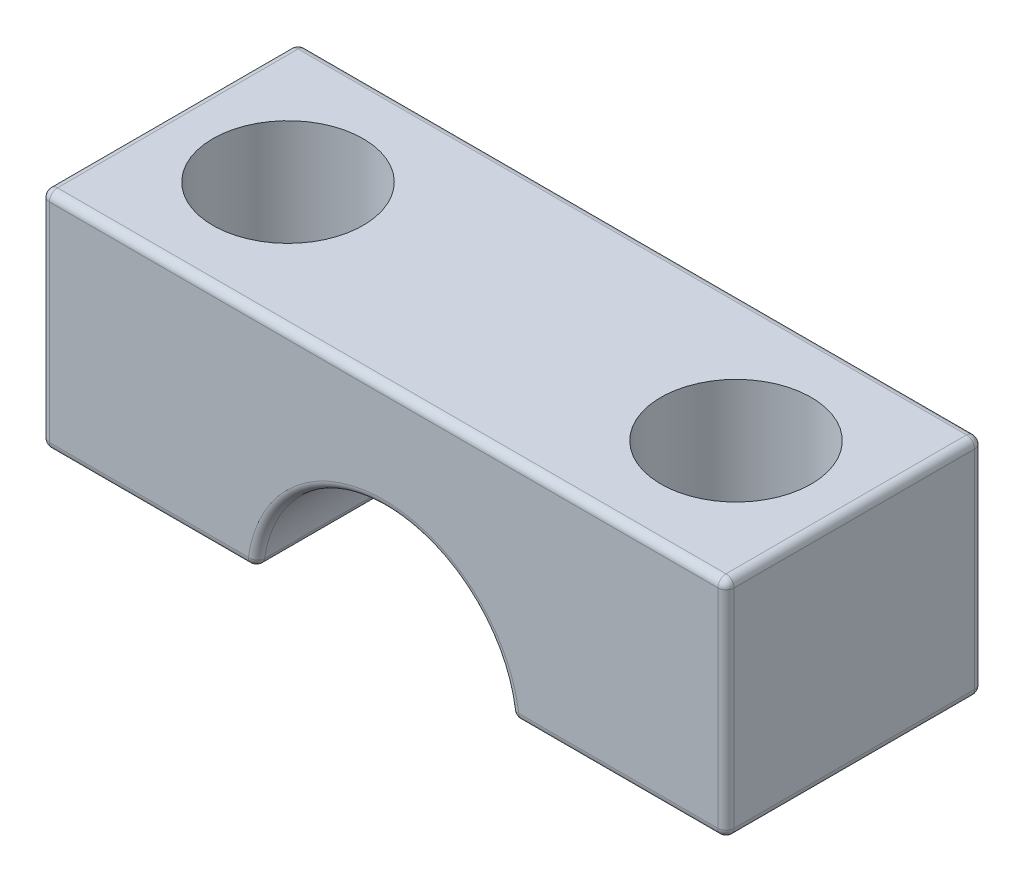
ISO-10303-21;
HEADER;
FILE_DESCRIPTION(('STEP AP214'),'2;1');
FILE_NAME('part.step','',(''),(''),'','','');
FILE_SCHEMA(('AUTOMOTIVE_DESIGN { 1 0 10303 214 1 1 1 1 }'));
ENDSEC;
DATA;
#1=APPLICATION_CONTEXT('core data for automotive mechanical design processes');
#2=APPLICATION_PROTOCOL_DEFINITION('international standard','automotive_design',2000,#1);
#3=PRODUCT_CONTEXT('',#1,'mechanical');
#4=PRODUCT('Part','Part','',(#3));
#5=PRODUCT_RELATED_PRODUCT_CATEGORY('part','',(#4));
#6=PRODUCT_DEFINITION_FORMATION('','',#4);
#7=PRODUCT_DEFINITION_CONTEXT('part definition',#1,'design');
#8=PRODUCT_DEFINITION('design','',#6,#7);
#9=PRODUCT_DEFINITION_SHAPE('','',#8);
#10=(LENGTH_UNIT() NAMED_UNIT(*) SI_UNIT(.MILLI.,.METRE.));
#11=(NAMED_UNIT(*) PLANE_ANGLE_UNIT() SI_UNIT($,.RADIAN.));
#12=(NAMED_UNIT(*) SI_UNIT($,.STERADIAN.) SOLID_ANGLE_UNIT());
#13=UNCERTAINTY_MEASURE_WITH_UNIT(LENGTH_MEASURE(1.E-05),#10,'distance_accuracy_value','');
#14=(GEOMETRIC_REPRESENTATION_CONTEXT(3) GLOBAL_UNCERTAINTY_ASSIGNED_CONTEXT((#13)) GLOBAL_UNIT_ASSIGNED_CONTEXT((#10,
#11,#12)) REPRESENTATION_CONTEXT('',''));
#15=CARTESIAN_POINT('',(0.,0.,0.));
#16=DIRECTION('',(0.,0.,1.));
#17=DIRECTION('',(1.,0.,0.));
#18=AXIS2_PLACEMENT_3D('',#15,#16,#17);
#19=CARTESIAN_POINT('',(-10.468,0.,-6.));
#20=DIRECTION('',(0.,1.,0.));
#21=DIRECTION('',(-1.,0.,0.));
#22=AXIS2_PLACEMENT_3D('',#19,#20,#21);
#23=CYLINDRICAL_SURFACE('',#22,2.254);
#24=CARTESIAN_POINT('',(-10.468,11.968,-6.));
#25=DIRECTION('',(0.,-1.,0.));
#26=DIRECTION('',(1.,0.,0.));
#27=AXIS2_PLACEMENT_3D('',#24,#25,#26);
#28=CIRCLE('',#27,2.254);
#29=CARTESIAN_POINT('',(-8.214,11.968,-6.));
#30=VERTEX_POINT('',#29);
#31=EDGE_CURVE('E380',#30,#30,#28,.T.);
#32=ORIENTED_EDGE('',*,*,#31,.T.);
#33=EDGE_LOOP('',(#32));
#34=FACE_BOUND('',#33,.T.);
#35=CARTESIAN_POINT('',(-10.468,15.445,-6.));
#36=DIRECTION('',(0.,1.,0.));
#37=DIRECTION('',(-1.,0.,0.));
#38=AXIS2_PLACEMENT_3D('',#35,#36,#37);
#39=CIRCLE('',#38,2.254);
#40=CARTESIAN_POINT('',(-12.722,15.445,-6.));
#41=VERTEX_POINT('',#40);
#42=EDGE_CURVE('E370',#41,#41,#39,.F.);
#43=ORIENTED_EDGE('',*,*,#42,.F.);
#44=EDGE_LOOP('',(#43));
#45=FACE_BOUND('',#44,.T.);
#46=ADVANCED_FACE('F39',(#34,#45),#23,.F.);
#47=CARTESIAN_POINT('',(-16.,11.968,-12.));
#48=DIRECTION('',(-1.,0.,0.));
#49=DIRECTION('',(0.,0.,1.));
#50=AXIS2_PLACEMENT_3D('',#47,#48,#49);
#51=PLANE('',#50);
#52=DIRECTION('',(0.,0.,1.));
#53=VECTOR('',#52,1.);
#54=CARTESIAN_POINT('',(-16.,22.079,-12.));
#55=LINE('',#54,#53);
#56=CARTESIAN_POINT('',(-16.,22.079,-0.381));
#57=VERTEX_POINT('',#56);
#58=CARTESIAN_POINT('',(-16.,22.079,-11.619));
#59=VERTEX_POINT('',#58);
#60=EDGE_CURVE('E59',#57,#59,#55,.F.);
#61=ORIENTED_EDGE('',*,*,#60,.T.);
#62=DIRECTION('',(0.,-1.,0.));
#63=VECTOR('',#62,1.);
#64=CARTESIAN_POINT('',(-16.,11.968,-11.619));
#65=LINE('',#64,#63);
#66=CARTESIAN_POINT('',(-16.,12.349,-11.619));
#67=VERTEX_POINT('',#66);
#68=EDGE_CURVE('E11',#59,#67,#65,.T.);
#69=ORIENTED_EDGE('',*,*,#68,.T.);
#70=DIRECTION('',(0.,0.,1.));
#71=VECTOR('',#70,1.);
#72=CARTESIAN_POINT('',(-16.,12.349,-12.));
#73=LINE('',#72,#71);
#74=CARTESIAN_POINT('',(-16.,12.349,-0.381));
#75=VERTEX_POINT('',#74);
#76=EDGE_CURVE('E48',#67,#75,#73,.T.);
#77=ORIENTED_EDGE('',*,*,#76,.T.);
#78=DIRECTION('',(0.,-1.,0.));
#79=VECTOR('',#78,1.);
#80=CARTESIAN_POINT('',(-16.,11.968,-0.380999999999999));
#81=LINE('',#80,#79);
#82=EDGE_CURVE('E263',#75,#57,#81,.F.);
#83=ORIENTED_EDGE('',*,*,#82,.T.);
#84=EDGE_LOOP('',(#61,#69,#77,#83));
#85=FACE_BOUND('',#84,.T.);
#86=ADVANCED_FACE('F444',(#85),#51,.T.);
#87=CARTESIAN_POINT('',(-16.,22.46,-12.));
#88=DIRECTION('',(0.,1.,0.));
#89=DIRECTION('',(-1.,0.,0.));
#90=AXIS2_PLACEMENT_3D('',#87,#88,#89);
#91=PLANE('',#90);
#92=DIRECTION('',(-1.,0.,0.));
#93=VECTOR('',#92,1.);
#94=CARTESIAN_POINT('',(-16.,22.46,-0.380999999999999));
#95=LINE('',#94,#93);
#96=CARTESIAN_POINT('',(-15.619,22.46,-0.381));
#97=VERTEX_POINT('',#96);
#98=CARTESIAN_POINT('',(15.619,22.46,-0.381));
#99=VERTEX_POINT('',#98);
#100=EDGE_CURVE('E199',#97,#99,#95,.F.);
#101=ORIENTED_EDGE('',*,*,#100,.T.);
#102=DIRECTION('',(0.,0.,1.));
#103=VECTOR('',#102,1.);
#104=CARTESIAN_POINT('',(15.619,22.46,-12.));
#105=LINE('',#104,#103);
#106=CARTESIAN_POINT('',(15.619,22.46,-11.619));
#107=VERTEX_POINT('',#106);
#108=EDGE_CURVE('E170',#99,#107,#105,.F.);
#109=ORIENTED_EDGE('',*,*,#108,.T.);
#110=DIRECTION('',(-1.,0.,0.));
#111=VECTOR('',#110,1.);
#112=CARTESIAN_POINT('',(-16.,22.46,-11.619));
#113=LINE('',#112,#111);
#114=CARTESIAN_POINT('',(-15.619,22.46,-11.619));
#115=VERTEX_POINT('',#114);
#116=EDGE_CURVE('E207',#107,#115,#113,.T.);
#117=ORIENTED_EDGE('',*,*,#116,.T.);
#118=DIRECTION('',(0.,0.,1.));
#119=VECTOR('',#118,1.);
#120=CARTESIAN_POINT('',(-15.619,22.46,-12.));
#121=LINE('',#120,#119);
#122=EDGE_CURVE('E201',#115,#97,#121,.T.);
#123=ORIENTED_EDGE('',*,*,#122,.T.);
#124=EDGE_LOOP('',(#101,#109,#117,#123));
#125=FACE_BOUND('',#124,.T.);
#126=CARTESIAN_POINT('',(-10.468,22.46,-6.));
#127=DIRECTION('',(0.,1.,0.));
#128=DIRECTION('',(-1.,0.,0.));
#129=AXIS2_PLACEMENT_3D('',#126,#127,#128);
#130=CIRCLE('',#129,3.5125);
#131=CARTESIAN_POINT('',(-13.9805,22.46,-6.));
#132=VERTEX_POINT('',#131);
#133=EDGE_CURVE('E359',#132,#132,#130,.T.);
#134=ORIENTED_EDGE('',*,*,#133,.F.);
#135=EDGE_LOOP('',(#134));
#136=FACE_BOUND('',#135,.T.);
#137=CARTESIAN_POINT('',(10.468,22.46,-6.));
#138=DIRECTION('',(0.,1.,0.));
#139=DIRECTION('',(1.,0.,0.));
#140=AXIS2_PLACEMENT_3D('',#137,#138,#139);
#141=CIRCLE('',#140,3.5125);
#142=CARTESIAN_POINT('',(13.9805,22.46,-6.));
#143=VERTEX_POINT('',#142);
#144=EDGE_CURVE('E377',#143,#143,#141,.T.);
#145=ORIENTED_EDGE('',*,*,#144,.F.);
#146=EDGE_LOOP('',(#145));
#147=FACE_BOUND('',#146,.T.);
#148=ADVANCED_FACE('F412',(#125,#136,#147),#91,.T.);
#149=CARTESIAN_POINT('',(16.,11.968,-12.));
#150=DIRECTION('',(1.,0.,0.));
#151=DIRECTION('',(0.,0.,-1.));
#152=AXIS2_PLACEMENT_3D('',#149,#150,#151);
#153=PLANE('',#152);
#154=DIRECTION('',(0.,1.,0.));
#155=VECTOR('',#154,1.);
#156=CARTESIAN_POINT('',(16.,22.46,-11.619));
#157=LINE('',#156,#155);
#158=CARTESIAN_POINT('',(16.,12.349,-11.619));
#159=VERTEX_POINT('',#158);
#160=CARTESIAN_POINT('',(16.,22.079,-11.619));
#161=VERTEX_POINT('',#160);
#162=EDGE_CURVE('E197',#159,#161,#157,.T.);
#163=ORIENTED_EDGE('',*,*,#162,.T.);
#164=DIRECTION('',(0.,0.,1.));
#165=VECTOR('',#164,1.);
#166=CARTESIAN_POINT('',(16.,22.079,-12.));
#167=LINE('',#166,#165);
#168=CARTESIAN_POINT('',(16.,22.079,-0.381));
#169=VERTEX_POINT('',#168);
#170=EDGE_CURVE('E168',#161,#169,#167,.T.);
#171=ORIENTED_EDGE('',*,*,#170,.T.);
#172=DIRECTION('',(0.,1.,0.));
#173=VECTOR('',#172,1.);
#174=CARTESIAN_POINT('',(16.,11.968,-0.380999999999999));
#175=LINE('',#174,#173);
#176=CARTESIAN_POINT('',(16.,12.349,-0.381));
#177=VERTEX_POINT('',#176);
#178=EDGE_CURVE('E186',#169,#177,#175,.F.);
#179=ORIENTED_EDGE('',*,*,#178,.T.);
#180=DIRECTION('',(0.,0.,1.));
#181=VECTOR('',#180,1.);
#182=CARTESIAN_POINT('',(16.,12.349,-12.));
#183=LINE('',#182,#181);
#184=EDGE_CURVE('E192',#177,#159,#183,.F.);
#185=ORIENTED_EDGE('',*,*,#184,.T.);
#186=EDGE_LOOP('',(#163,#171,#179,#185));
#187=FACE_BOUND('',#186,.T.);
#188=ADVANCED_FACE('F195',(#187),#153,.T.);
#189=CARTESIAN_POINT('',(5.97845598796211,11.968,-12.));
#190=DIRECTION('',(0.,-1.,0.));
#191=DIRECTION('',(1.,0.,0.));
#192=AXIS2_PLACEMENT_3D('',#189,#190,#191);
#193=PLANE('',#192);
#194=DIRECTION('',(0.,0.,1.));
#195=VECTOR('',#194,1.);
#196=CARTESIAN_POINT('',(6.31876886742979,11.968,-12.));
#197=LINE('',#196,#195);
#198=CARTESIAN_POINT('',(6.31876886742979,11.968,-0.381));
#199=VERTEX_POINT('',#198);
#200=CARTESIAN_POINT('',(6.31876886742979,11.968,-11.619));
#201=VERTEX_POINT('',#200);
#202=EDGE_CURVE('E225',#199,#201,#197,.F.);
#203=ORIENTED_EDGE('',*,*,#202,.T.);
#204=DIRECTION('',(1.,0.,0.));
#205=VECTOR('',#204,1.);
#206=CARTESIAN_POINT('',(16.,11.968,-11.619));
#207=LINE('',#206,#205);
#208=CARTESIAN_POINT('',(15.619,11.968,-11.619));
#209=VERTEX_POINT('',#208);
#210=EDGE_CURVE('E230',#201,#209,#207,.T.);
#211=ORIENTED_EDGE('',*,*,#210,.T.);
#212=DIRECTION('',(0.,0.,1.));
#213=VECTOR('',#212,1.);
#214=CARTESIAN_POINT('',(15.619,11.968,-12.));
#215=LINE('',#214,#213);
#216=CARTESIAN_POINT('',(15.619,11.968,-0.381));
#217=VERTEX_POINT('',#216);
#218=EDGE_CURVE('E227',#209,#217,#215,.T.);
#219=ORIENTED_EDGE('',*,*,#218,.T.);
#220=DIRECTION('',(1.,0.,0.));
#221=VECTOR('',#220,1.);
#222=CARTESIAN_POINT('',(5.97845598796211,11.968,-0.380999999999999));
#223=LINE('',#222,#221);
#224=EDGE_CURVE('E223',#217,#199,#223,.F.);
#225=ORIENTED_EDGE('',*,*,#224,.T.);
#226=EDGE_LOOP('',(#203,#211,#219,#225));
#227=FACE_BOUND('',#226,.T.);
#228=CARTESIAN_POINT('',(10.468,11.968,-6.));
#229=DIRECTION('',(0.,-1.,0.));
#230=DIRECTION('',(1.,0.,0.));
#231=AXIS2_PLACEMENT_3D('',#228,#229,#230);
#232=CIRCLE('',#231,2.254);
#233=CARTESIAN_POINT('',(12.722,11.968,-6.));
#234=VERTEX_POINT('',#233);
#235=EDGE_CURVE('E193',#234,#234,#232,.T.);
#236=ORIENTED_EDGE('',*,*,#235,.F.);
#237=EDGE_LOOP('',(#236));
#238=FACE_BOUND('',#237,.T.);
#239=ADVANCED_FACE('F468',(#227,#238),#193,.T.);
#240=CARTESIAN_POINT('',(0.,11.46,-12.));
#241=DIRECTION('',(0.,0.,1.));
#242=DIRECTION('',(1.,0.,0.));
#243=AXIS2_PLACEMENT_3D('',#240,#241,#242);
#244=CYLINDRICAL_SURFACE('',#243,6.);
#245=DIRECTION('',(0.,0.,1.));
#246=VECTOR('',#245,1.);
#247=CARTESIAN_POINT('',(5.94148459560865,12.2959191349318,-12.));
#248=LINE('',#247,#246);
#249=CARTESIAN_POINT('',(5.94148459560864,12.2959191349318,-11.619));
#250=VERTEX_POINT('',#249);
#251=CARTESIAN_POINT('',(5.94148459560864,12.2959191349318,-0.380999999999999));
#252=VERTEX_POINT('',#251);
#253=EDGE_CURVE('E249',#250,#252,#248,.T.);
#254=ORIENTED_EDGE('',*,*,#253,.T.);
#255=CARTESIAN_POINT('',(0.,11.46,-0.380999999999999));
#256=DIRECTION('',(0.,0.,1.));
#257=DIRECTION('',(1.,0.,0.));
#258=AXIS2_PLACEMENT_3D('',#255,#256,#257);
#259=CIRCLE('',#258,6.);
#260=CARTESIAN_POINT('',(-5.94148459560865,12.2959191349318,-0.380999999999999));
#261=VERTEX_POINT('',#260);
#262=EDGE_CURVE('E252',#252,#261,#259,.T.);
#263=ORIENTED_EDGE('',*,*,#262,.T.);
#264=DIRECTION('',(0.,0.,1.));
#265=VECTOR('',#264,1.);
#266=CARTESIAN_POINT('',(-5.94148459560865,12.2959191349318,-12.));
#267=LINE('',#266,#265);
#268=CARTESIAN_POINT('',(-5.94148459560865,12.2959191349318,-11.619));
#269=VERTEX_POINT('',#268);
#270=EDGE_CURVE('E247',#261,#269,#267,.F.);
#271=ORIENTED_EDGE('',*,*,#270,.T.);
#272=CARTESIAN_POINT('',(0.,11.46,-11.619));
#273=DIRECTION('',(0.,0.,1.));
#274=DIRECTION('',(1.,0.,0.));
#275=AXIS2_PLACEMENT_3D('',#272,#273,#274);
#276=CIRCLE('',#275,6.);
#277=EDGE_CURVE('E245',#269,#250,#276,.F.);
#278=ORIENTED_EDGE('',*,*,#277,.T.);
#279=EDGE_LOOP('',(#254,#263,#271,#278));
#280=FACE_BOUND('',#279,.T.);
#281=ADVANCED_FACE('F471',(#280),#244,.F.);
#282=CARTESIAN_POINT('',(-16.,11.968,-12.));
#283=DIRECTION('',(0.,-1.,0.));
#284=DIRECTION('',(1.,0.,0.));
#285=AXIS2_PLACEMENT_3D('',#282,#283,#284);
#286=PLANE('',#285);
#287=DIRECTION('',(1.,0.,0.));
#288=VECTOR('',#287,1.);
#289=CARTESIAN_POINT('',(-5.97845598796211,11.968,-11.619));
#290=LINE('',#289,#288);
#291=CARTESIAN_POINT('',(-15.619,11.968,-11.619));
#292=VERTEX_POINT('',#291);
#293=CARTESIAN_POINT('',(-6.31876886742979,11.968,-11.619));
#294=VERTEX_POINT('',#293);
#295=EDGE_CURVE('E258',#292,#294,#290,.T.);
#296=ORIENTED_EDGE('',*,*,#295,.T.);
#297=DIRECTION('',(0.,0.,1.));
#298=VECTOR('',#297,1.);
#299=CARTESIAN_POINT('',(-6.31876886742979,11.968,-12.));
#300=LINE('',#299,#298);
#301=CARTESIAN_POINT('',(-6.31876886742979,11.968,-0.381));
#302=VERTEX_POINT('',#301);
#303=EDGE_CURVE('E260',#294,#302,#300,.T.);
#304=ORIENTED_EDGE('',*,*,#303,.T.);
#305=DIRECTION('',(1.,0.,0.));
#306=VECTOR('',#305,1.);
#307=CARTESIAN_POINT('',(-16.,11.968,-0.380999999999999));
#308=LINE('',#307,#306);
#309=CARTESIAN_POINT('',(-15.619,11.968,-0.381));
#310=VERTEX_POINT('',#309);
#311=EDGE_CURVE('E254',#302,#310,#308,.F.);
#312=ORIENTED_EDGE('',*,*,#311,.T.);
#313=DIRECTION('',(0.,0.,1.));
#314=VECTOR('',#313,1.);
#315=CARTESIAN_POINT('',(-15.619,11.968,-12.));
#316=LINE('',#315,#314);
#317=EDGE_CURVE('E256',#310,#292,#316,.F.);
#318=ORIENTED_EDGE('',*,*,#317,.T.);
#319=EDGE_LOOP('',(#296,#304,#312,#318));
#320=FACE_BOUND('',#319,.T.);
#321=ORIENTED_EDGE('',*,*,#31,.F.);
#322=EDGE_LOOP('',(#321));
#323=FACE_BOUND('',#322,.T.);
#324=ADVANCED_FACE('F460',(#320,#323),#286,.T.);
#325=CARTESIAN_POINT('',(0.,11.46,-12.));
#326=DIRECTION('',(0.,0.,1.));
#327=DIRECTION('',(1.,0.,0.));
#328=AXIS2_PLACEMENT_3D('',#325,#326,#327);
#329=PLANE('',#328);
#330=DIRECTION('',(0.,1.,0.));
#331=VECTOR('',#330,1.);
#332=CARTESIAN_POINT('',(15.619,11.968,-12.));
#333=LINE('',#332,#331);
#334=CARTESIAN_POINT('',(15.619,22.079,-12.));
#335=VERTEX_POINT('',#334);
#336=CARTESIAN_POINT('',(15.619,12.349,-12.));
#337=VERTEX_POINT('',#336);
#338=EDGE_CURVE('E218',#335,#337,#333,.F.);
#339=ORIENTED_EDGE('',*,*,#338,.T.);
#340=DIRECTION('',(1.,0.,0.));
#341=VECTOR('',#340,1.);
#342=CARTESIAN_POINT('',(5.97845598796211,12.349,-12.));
#343=LINE('',#342,#341);
#344=CARTESIAN_POINT('',(6.31876886742979,12.349,-12.));
#345=VERTEX_POINT('',#344);
#346=EDGE_CURVE('E221',#337,#345,#343,.F.);
#347=ORIENTED_EDGE('',*,*,#346,.T.);
#348=CARTESIAN_POINT('',(0.,11.46,-12.));
#349=DIRECTION('',(0.,0.,1.));
#350=DIRECTION('',(1.,0.,0.));
#351=AXIS2_PLACEMENT_3D('',#348,#349,#350);
#352=CIRCLE('',#351,6.381);
#353=CARTESIAN_POINT('',(-6.31876886742979,12.349,-12.));
#354=VERTEX_POINT('',#353);
#355=EDGE_CURVE('E216',#345,#354,#352,.T.);
#356=ORIENTED_EDGE('',*,*,#355,.T.);
#357=DIRECTION('',(1.,0.,0.));
#358=VECTOR('',#357,1.);
#359=CARTESIAN_POINT('',(-16.,12.349,-12.));
#360=LINE('',#359,#358);
#361=CARTESIAN_POINT('',(-15.619,12.349,-12.));
#362=VERTEX_POINT('',#361);
#363=EDGE_CURVE('E214',#354,#362,#360,.F.);
#364=ORIENTED_EDGE('',*,*,#363,.T.);
#365=DIRECTION('',(0.,-1.,0.));
#366=VECTOR('',#365,1.);
#367=CARTESIAN_POINT('',(-15.619,22.46,-12.));
#368=LINE('',#367,#366);
#369=CARTESIAN_POINT('',(-15.619,22.079,-12.));
#370=VERTEX_POINT('',#369);
#371=EDGE_CURVE('E210',#362,#370,#368,.F.);
#372=ORIENTED_EDGE('',*,*,#371,.T.);
#373=DIRECTION('',(-1.,0.,0.));
#374=VECTOR('',#373,1.);
#375=CARTESIAN_POINT('',(16.,22.079,-12.));
#376=LINE('',#375,#374);
#377=EDGE_CURVE('E212',#370,#335,#376,.F.);
#378=ORIENTED_EDGE('',*,*,#377,.T.);
#379=EDGE_LOOP('',(#339,#347,#356,#364,#372,#378));
#380=FACE_BOUND('',#379,.T.);
#381=ADVANCED_FACE('F457',(#380),#329,.F.);
#382=CARTESIAN_POINT('',(0.,11.46,0.));
#383=DIRECTION('',(0.,0.,1.));
#384=DIRECTION('',(1.,0.,0.));
#385=AXIS2_PLACEMENT_3D('',#382,#383,#384);
#386=PLANE('',#385);
#387=CARTESIAN_POINT('',(0.,11.46,0.));
#388=DIRECTION('',(0.,0.,1.));
#389=DIRECTION('',(1.,0.,0.));
#390=AXIS2_PLACEMENT_3D('',#387,#388,#389);
#391=CIRCLE('',#390,6.381);
#392=CARTESIAN_POINT('',(-6.31876886742979,12.349,0.));
#393=VERTEX_POINT('',#392);
#394=CARTESIAN_POINT('',(6.31876886742979,12.349,0.));
#395=VERTEX_POINT('',#394);
#396=EDGE_CURVE('E238',#393,#395,#391,.F.);
#397=ORIENTED_EDGE('',*,*,#396,.T.);
#398=DIRECTION('',(1.,0.,0.));
#399=VECTOR('',#398,1.);
#400=CARTESIAN_POINT('',(0.,12.349,0.));
#401=LINE('',#400,#399);
#402=CARTESIAN_POINT('',(15.619,12.349,0.));
#403=VERTEX_POINT('',#402);
#404=EDGE_CURVE('E243',#395,#403,#401,.T.);
#405=ORIENTED_EDGE('',*,*,#404,.T.);
#406=DIRECTION('',(0.,1.,0.));
#407=VECTOR('',#406,1.);
#408=CARTESIAN_POINT('',(15.619,11.46,0.));
#409=LINE('',#408,#407);
#410=CARTESIAN_POINT('',(15.619,22.079,0.));
#411=VERTEX_POINT('',#410);
#412=EDGE_CURVE('E240',#403,#411,#409,.T.);
#413=ORIENTED_EDGE('',*,*,#412,.T.);
#414=DIRECTION('',(-1.,0.,0.));
#415=VECTOR('',#414,1.);
#416=CARTESIAN_POINT('',(0.,22.079,0.));
#417=LINE('',#416,#415);
#418=CARTESIAN_POINT('',(-15.619,22.079,0.));
#419=VERTEX_POINT('',#418);
#420=EDGE_CURVE('E232',#411,#419,#417,.T.);
#421=ORIENTED_EDGE('',*,*,#420,.T.);
#422=DIRECTION('',(0.,-1.,0.));
#423=VECTOR('',#422,1.);
#424=CARTESIAN_POINT('',(-15.619,11.46,0.));
#425=LINE('',#424,#423);
#426=CARTESIAN_POINT('',(-15.619,12.349,0.));
#427=VERTEX_POINT('',#426);
#428=EDGE_CURVE('E234',#419,#427,#425,.T.);
#429=ORIENTED_EDGE('',*,*,#428,.T.);
#430=DIRECTION('',(1.,0.,0.));
#431=VECTOR('',#430,1.);
#432=CARTESIAN_POINT('',(0.,12.349,0.));
#433=LINE('',#432,#431);
#434=EDGE_CURVE('E236',#427,#393,#433,.T.);
#435=ORIENTED_EDGE('',*,*,#434,.T.);
#436=EDGE_LOOP('',(#397,#405,#413,#421,#429,#435));
#437=FACE_BOUND('',#436,.T.);
#438=ADVANCED_FACE('F421',(#437),#386,.T.);
#439=CARTESIAN_POINT('',(10.468,0.,-6.));
#440=DIRECTION('',(0.,1.,0.));
#441=DIRECTION('',(-1.,0.,0.));
#442=AXIS2_PLACEMENT_3D('',#439,#440,#441);
#443=CYLINDRICAL_SURFACE('',#442,2.254);
#444=CARTESIAN_POINT('',(10.468,15.445,-6.));
#445=DIRECTION('',(0.,-1.,0.));
#446=DIRECTION('',(1.,0.,0.));
#447=AXIS2_PLACEMENT_3D('',#444,#445,#446);
#448=CIRCLE('',#447,2.254);
#449=CARTESIAN_POINT('',(12.722,15.445,-6.));
#450=VERTEX_POINT('',#449);
#451=EDGE_CURVE('E376',#450,#450,#448,.F.);
#452=ORIENTED_EDGE('',*,*,#451,.T.);
#453=EDGE_LOOP('',(#452));
#454=FACE_BOUND('',#453,.T.);
#455=ORIENTED_EDGE('',*,*,#235,.T.);
#456=EDGE_LOOP('',(#455));
#457=FACE_BOUND('',#456,.T.);
#458=ADVANCED_FACE('F455',(#454,#457),#443,.F.);
#459=CARTESIAN_POINT('',(10.468,15.445,-6.));
#460=DIRECTION('',(0.,-1.,0.));
#461=DIRECTION('',(1.,0.,0.));
#462=AXIS2_PLACEMENT_3D('',#459,#460,#461);
#463=PLANE('',#462);
#464=CARTESIAN_POINT('',(10.468,15.445,-6.));
#465=DIRECTION('',(0.,1.,0.));
#466=DIRECTION('',(1.,0.,0.));
#467=AXIS2_PLACEMENT_3D('',#464,#465,#466);
#468=CIRCLE('',#467,3.5125);
#469=CARTESIAN_POINT('',(13.9805,15.445,-6.));
#470=VERTEX_POINT('',#469);
#471=EDGE_CURVE('E373',#470,#470,#468,.T.);
#472=ORIENTED_EDGE('',*,*,#471,.T.);
#473=EDGE_LOOP('',(#472));
#474=FACE_BOUND('',#473,.T.);
#475=ORIENTED_EDGE('',*,*,#451,.F.);
#476=EDGE_LOOP('',(#475));
#477=FACE_BOUND('',#476,.T.);
#478=ADVANCED_FACE('F789',(#474,#477),#463,.F.);
#479=CARTESIAN_POINT('',(10.468,15.445,-6.));
#480=DIRECTION('',(0.,1.,0.));
#481=DIRECTION('',(-1.,0.,0.));
#482=AXIS2_PLACEMENT_3D('',#479,#480,#481);
#483=CYLINDRICAL_SURFACE('',#482,3.5125);
#484=ORIENTED_EDGE('',*,*,#471,.F.);
#485=EDGE_LOOP('',(#484));
#486=FACE_BOUND('',#485,.T.);
#487=ORIENTED_EDGE('',*,*,#144,.T.);
#488=EDGE_LOOP('',(#487));
#489=FACE_BOUND('',#488,.T.);
#490=ADVANCED_FACE('F780',(#486,#489),#483,.F.);
#491=CARTESIAN_POINT('',(-10.468,15.445,-6.));
#492=DIRECTION('',(0.,1.,0.));
#493=DIRECTION('',(-1.,0.,0.));
#494=AXIS2_PLACEMENT_3D('',#491,#492,#493);
#495=PLANE('',#494);
#496=CARTESIAN_POINT('',(-10.468,15.445,-6.));
#497=DIRECTION('',(0.,1.,0.));
#498=DIRECTION('',(-1.,0.,0.));
#499=AXIS2_PLACEMENT_3D('',#496,#497,#498);
#500=CIRCLE('',#499,3.5125);
#501=CARTESIAN_POINT('',(-13.9805,15.445,-6.));
#502=VERTEX_POINT('',#501);
#503=EDGE_CURVE('E365',#502,#502,#500,.T.);
#504=ORIENTED_EDGE('',*,*,#503,.T.);
#505=EDGE_LOOP('',(#504));
#506=FACE_BOUND('',#505,.T.);
#507=ORIENTED_EDGE('',*,*,#42,.T.);
#508=EDGE_LOOP('',(#507));
#509=FACE_BOUND('',#508,.T.);
#510=ADVANCED_FACE('F771',(#506,#509),#495,.T.);
#511=CARTESIAN_POINT('',(-10.468,15.445,-6.));
#512=DIRECTION('',(0.,1.,0.));
#513=DIRECTION('',(-1.,0.,0.));
#514=AXIS2_PLACEMENT_3D('',#511,#512,#513);
#515=CYLINDRICAL_SURFACE('',#514,3.5125);
#516=ORIENTED_EDGE('',*,*,#503,.F.);
#517=EDGE_LOOP('',(#516));
#518=FACE_BOUND('',#517,.T.);
#519=ORIENTED_EDGE('',*,*,#133,.T.);
#520=EDGE_LOOP('',(#519));
#521=FACE_BOUND('',#520,.T.);
#522=ADVANCED_FACE('F763',(#518,#521),#515,.F.);
#523=CARTESIAN_POINT('',(-6.31876886742979,12.349,-12.));
#524=DIRECTION('',(0.,0.,1.));
#525=DIRECTION('',(1.,0.,0.));
#526=AXIS2_PLACEMENT_3D('',#523,#524,#525);
#527=CYLINDRICAL_SURFACE('',#526,0.381);
#528=CARTESIAN_POINT('',(-6.31876886742979,12.349,-11.619));
#529=DIRECTION('',(0.,0.,-1.));
#530=DIRECTION('',(-1.,0.,0.));
#531=AXIS2_PLACEMENT_3D('',#528,#529,#530);
#532=CIRCLE('',#531,0.381);
#533=EDGE_CURVE('E43',#269,#294,#532,.T.);
#534=ORIENTED_EDGE('',*,*,#533,.F.);
#535=ORIENTED_EDGE('',*,*,#270,.F.);
#536=CARTESIAN_POINT('',(-6.31876886742979,12.349,-0.381));
#537=DIRECTION('',(0.,0.,1.));
#538=DIRECTION('',(1.,0.,0.));
#539=AXIS2_PLACEMENT_3D('',#536,#537,#538);
#540=CIRCLE('',#539,0.381);
#541=EDGE_CURVE('E352',#302,#261,#540,.T.);
#542=ORIENTED_EDGE('',*,*,#541,.F.);
#543=ORIENTED_EDGE('',*,*,#303,.F.);
#544=EDGE_LOOP('',(#534,#535,#542,#543));
#545=FACE_BOUND('',#544,.T.);
#546=ADVANCED_FACE('F41',(#545),#527,.T.);
#547=CARTESIAN_POINT('',(-6.31876886742979,12.349,-11.619));
#548=DIRECTION('',(0.,0.,1.));
#549=DIRECTION('',(1.,0.,0.));
#550=AXIS2_PLACEMENT_3D('',#547,#548,#549);
#551=SPHERICAL_SURFACE('',#550,0.381);
#552=CARTESIAN_POINT('',(-6.31876886742979,12.349,-11.619));
#553=DIRECTION('',(-0.139319855821969,-0.990247432601441,0.));
#554=DIRECTION('',(0.990247432601441,-0.139319855821969,0.));
#555=AXIS2_PLACEMENT_3D('',#552,#553,#554);
#556=CIRCLE('',#555,0.381);
#557=EDGE_CURVE('E347',#269,#354,#556,.F.);
#558=ORIENTED_EDGE('',*,*,#557,.F.);
#559=ORIENTED_EDGE('',*,*,#533,.T.);
#560=CARTESIAN_POINT('',(-6.31876886742979,12.349,-11.619));
#561=DIRECTION('',(1.,0.,0.));
#562=DIRECTION('',(0.,0.,-1.));
#563=AXIS2_PLACEMENT_3D('',#560,#561,#562);
#564=CIRCLE('',#563,0.381);
#565=EDGE_CURVE('E350',#354,#294,#564,.F.);
#566=ORIENTED_EDGE('',*,*,#565,.F.);
#567=EDGE_LOOP('',(#558,#559,#566));
#568=FACE_BOUND('',#567,.T.);
#569=ADVANCED_FACE('F749',(#568),#551,.T.);
#570=CARTESIAN_POINT('',(-6.31876886742979,12.349,-0.381));
#571=DIRECTION('',(0.,0.,1.));
#572=DIRECTION('',(1.,0.,0.));
#573=AXIS2_PLACEMENT_3D('',#570,#571,#572);
#574=SPHERICAL_SURFACE('',#573,0.381);
#575=CARTESIAN_POINT('',(-6.31876886742979,12.349,-0.381));
#576=DIRECTION('',(1.,0.,0.));
#577=DIRECTION('',(0.,1.,0.));
#578=AXIS2_PLACEMENT_3D('',#575,#576,#577);
#579=CIRCLE('',#578,0.381);
#580=EDGE_CURVE('E341',#302,#393,#579,.F.);
#581=ORIENTED_EDGE('',*,*,#580,.F.);
#582=ORIENTED_EDGE('',*,*,#541,.T.);
#583=CARTESIAN_POINT('',(-6.31876886742979,12.349,-0.380999999999999));
#584=DIRECTION('',(-0.139319855821974,-0.99024743260144,0.));
#585=DIRECTION('',(0.990247432601441,-0.139319855821974,0.));
#586=AXIS2_PLACEMENT_3D('',#583,#584,#585);
#587=CIRCLE('',#586,0.381);
#588=EDGE_CURVE('E344',#393,#261,#587,.F.);
#589=ORIENTED_EDGE('',*,*,#588,.F.);
#590=EDGE_LOOP('',(#581,#582,#589));
#591=FACE_BOUND('',#590,.T.);
#592=ADVANCED_FACE('F740',(#591),#574,.T.);
#593=CARTESIAN_POINT('',(-16.,12.349,-11.619));
#594=DIRECTION('',(-1.,0.,0.));
#595=DIRECTION('',(0.,-1.,0.));
#596=AXIS2_PLACEMENT_3D('',#593,#594,#595);
#597=CYLINDRICAL_SURFACE('',#596,0.381);
#598=ORIENTED_EDGE('',*,*,#565,.T.);
#599=ORIENTED_EDGE('',*,*,#295,.F.);
#600=CARTESIAN_POINT('',(-15.619,12.349,-11.619));
#601=DIRECTION('',(-1.,0.,0.));
#602=DIRECTION('',(0.,0.,1.));
#603=AXIS2_PLACEMENT_3D('',#600,#601,#602);
#604=CIRCLE('',#603,0.381);
#605=EDGE_CURVE('E335',#362,#292,#604,.T.);
#606=ORIENTED_EDGE('',*,*,#605,.F.);
#607=ORIENTED_EDGE('',*,*,#363,.F.);
#608=EDGE_LOOP('',(#598,#599,#606,#607));
#609=FACE_BOUND('',#608,.T.);
#610=ADVANCED_FACE('F731',(#609),#597,.T.);
#611=CARTESIAN_POINT('',(0.,11.46,-11.619));
#612=DIRECTION('',(0.,0.,1.));
#613=DIRECTION('',(1.,0.,0.));
#614=AXIS2_PLACEMENT_3D('',#611,#612,#613);
#615=TOROIDAL_SURFACE('',#614,6.381,0.381);
#616=ORIENTED_EDGE('',*,*,#557,.T.);
#617=ORIENTED_EDGE('',*,*,#355,.F.);
#618=CARTESIAN_POINT('',(6.31876886742979,12.349,-11.619));
#619=DIRECTION('',(0.139319855821969,-0.990247432601441,0.));
#620=DIRECTION('',(0.990247432601441,0.139319855821969,0.));
#621=AXIS2_PLACEMENT_3D('',#618,#619,#620);
#622=CIRCLE('',#621,0.381);
#623=EDGE_CURVE('E332',#250,#345,#622,.T.);
#624=ORIENTED_EDGE('',*,*,#623,.F.);
#625=ORIENTED_EDGE('',*,*,#277,.F.);
#626=EDGE_LOOP('',(#616,#617,#624,#625));
#627=FACE_BOUND('',#626,.T.);
#628=ADVANCED_FACE('F722',(#627),#615,.T.);
#629=CARTESIAN_POINT('',(6.31876886742979,12.349,-12.));
#630=DIRECTION('',(0.,0.,1.));
#631=DIRECTION('',(1.,0.,0.));
#632=AXIS2_PLACEMENT_3D('',#629,#630,#631);
#633=CYLINDRICAL_SURFACE('',#632,0.381);
#634=CARTESIAN_POINT('',(6.31876886742979,12.349,-0.380999999999999));
#635=DIRECTION('',(0.,0.,1.));
#636=DIRECTION('',(0.,-1.,0.));
#637=AXIS2_PLACEMENT_3D('',#634,#635,#636);
#638=CIRCLE('',#637,0.381);
#639=EDGE_CURVE('E326',#252,#199,#638,.T.);
#640=ORIENTED_EDGE('',*,*,#639,.F.);
#641=ORIENTED_EDGE('',*,*,#253,.F.);
#642=CARTESIAN_POINT('',(6.31876886742979,12.349,-11.619));
#643=DIRECTION('',(0.,0.,-1.));
#644=DIRECTION('',(-1.,0.,0.));
#645=AXIS2_PLACEMENT_3D('',#642,#643,#644);
#646=CIRCLE('',#645,0.381);
#647=EDGE_CURVE('E329',#201,#250,#646,.T.);
#648=ORIENTED_EDGE('',*,*,#647,.F.);
#649=ORIENTED_EDGE('',*,*,#202,.F.);
#650=EDGE_LOOP('',(#640,#641,#648,#649));
#651=FACE_BOUND('',#650,.T.);
#652=ADVANCED_FACE('F713',(#651),#633,.T.);
#653=CARTESIAN_POINT('',(0.,11.46,-0.380999999999999));
#654=DIRECTION('',(0.,0.,1.));
#655=DIRECTION('',(1.,0.,0.));
#656=AXIS2_PLACEMENT_3D('',#653,#654,#655);
#657=TOROIDAL_SURFACE('',#656,6.381,0.381);
#658=ORIENTED_EDGE('',*,*,#588,.T.);
#659=ORIENTED_EDGE('',*,*,#262,.F.);
#660=CARTESIAN_POINT('',(6.31876886742979,12.349,-0.381));
#661=DIRECTION('',(0.139319855821974,-0.99024743260144,0.));
#662=DIRECTION('',(0.990247432601441,0.139319855821974,0.));
#663=AXIS2_PLACEMENT_3D('',#660,#661,#662);
#664=CIRCLE('',#663,0.381);
#665=EDGE_CURVE('E324',#395,#252,#664,.T.);
#666=ORIENTED_EDGE('',*,*,#665,.F.);
#667=ORIENTED_EDGE('',*,*,#396,.F.);
#668=EDGE_LOOP('',(#658,#659,#666,#667));
#669=FACE_BOUND('',#668,.T.);
#670=ADVANCED_FACE('F704',(#669),#657,.T.);
#671=CARTESIAN_POINT('',(0.,12.349,-0.381));
#672=DIRECTION('',(1.,0.,0.));
#673=DIRECTION('',(0.,1.,0.));
#674=AXIS2_PLACEMENT_3D('',#671,#672,#673);
#675=CYLINDRICAL_SURFACE('',#674,0.381);
#676=ORIENTED_EDGE('',*,*,#580,.T.);
#677=ORIENTED_EDGE('',*,*,#434,.F.);
#678=CARTESIAN_POINT('',(-15.619,12.349,-0.381));
#679=DIRECTION('',(-1.,0.,0.));
#680=DIRECTION('',(0.,0.,1.));
#681=AXIS2_PLACEMENT_3D('',#678,#679,#680);
#682=CIRCLE('',#681,0.381);
#683=EDGE_CURVE('E321',#310,#427,#682,.T.);
#684=ORIENTED_EDGE('',*,*,#683,.F.);
#685=ORIENTED_EDGE('',*,*,#311,.F.);
#686=EDGE_LOOP('',(#676,#677,#684,#685));
#687=FACE_BOUND('',#686,.T.);
#688=ADVANCED_FACE('F695',(#687),#675,.T.);
#689=CARTESIAN_POINT('',(-15.619,12.349,-12.));
#690=DIRECTION('',(0.,0.,1.));
#691=DIRECTION('',(1.,0.,0.));
#692=AXIS2_PLACEMENT_3D('',#689,#690,#691);
#693=CYLINDRICAL_SURFACE('',#692,0.381);
#694=CARTESIAN_POINT('',(-15.619,12.349,-11.619));
#695=DIRECTION('',(0.,0.,-1.));
#696=DIRECTION('',(-1.,0.,0.));
#697=AXIS2_PLACEMENT_3D('',#694,#695,#696);
#698=CIRCLE('',#697,0.381);
#699=EDGE_CURVE('E338',#292,#67,#698,.T.);
#700=ORIENTED_EDGE('',*,*,#699,.F.);
#701=ORIENTED_EDGE('',*,*,#317,.F.);
#702=CARTESIAN_POINT('',(-15.619,12.349,-0.381));
#703=DIRECTION('',(0.,0.,1.));
#704=DIRECTION('',(1.,0.,0.));
#705=AXIS2_PLACEMENT_3D('',#702,#703,#704);
#706=CIRCLE('',#705,0.381);
#707=EDGE_CURVE('E318',#75,#310,#706,.T.);
#708=ORIENTED_EDGE('',*,*,#707,.F.);
#709=ORIENTED_EDGE('',*,*,#76,.F.);
#710=EDGE_LOOP('',(#700,#701,#708,#709));
#711=FACE_BOUND('',#710,.T.);
#712=ADVANCED_FACE('F686',(#711),#693,.T.);
#713=CARTESIAN_POINT('',(-15.619,12.349,-11.619));
#714=DIRECTION('',(0.,0.,1.));
#715=DIRECTION('',(1.,0.,0.));
#716=AXIS2_PLACEMENT_3D('',#713,#714,#715);
#717=SPHERICAL_SURFACE('',#716,0.381);
#718=ORIENTED_EDGE('',*,*,#605,.T.);
#719=ORIENTED_EDGE('',*,*,#699,.T.);
#720=CARTESIAN_POINT('',(-15.619,12.349,-11.619));
#721=DIRECTION('',(0.,-1.,0.));
#722=DIRECTION('',(0.,0.,-1.));
#723=AXIS2_PLACEMENT_3D('',#720,#721,#722);
#724=CIRCLE('',#723,0.381);
#725=EDGE_CURVE('E315',#362,#67,#724,.F.);
#726=ORIENTED_EDGE('',*,*,#725,.F.);
#727=EDGE_LOOP('',(#718,#719,#726));
#728=FACE_BOUND('',#727,.T.);
#729=ADVANCED_FACE('F677',(#728),#717,.T.);
#730=CARTESIAN_POINT('',(6.31876886742979,12.349,-11.619));
#731=DIRECTION('',(0.,0.,1.));
#732=DIRECTION('',(1.,0.,0.));
#733=AXIS2_PLACEMENT_3D('',#730,#731,#732);
#734=SPHERICAL_SURFACE('',#733,0.381);
#735=ORIENTED_EDGE('',*,*,#647,.T.);
#736=ORIENTED_EDGE('',*,*,#623,.T.);
#737=CARTESIAN_POINT('',(6.31876886742979,12.349,-11.619));
#738=DIRECTION('',(-1.,0.,0.));
#739=DIRECTION('',(0.,0.,1.));
#740=AXIS2_PLACEMENT_3D('',#737,#738,#739);
#741=CIRCLE('',#740,0.381);
#742=EDGE_CURVE('E312',#201,#345,#741,.F.);
#743=ORIENTED_EDGE('',*,*,#742,.F.);
#744=EDGE_LOOP('',(#735,#736,#743));
#745=FACE_BOUND('',#744,.T.);
#746=ADVANCED_FACE('F668',(#745),#734,.T.);
#747=CARTESIAN_POINT('',(6.31876886742979,12.349,-0.381));
#748=DIRECTION('',(0.,0.,1.));
#749=DIRECTION('',(1.,0.,0.));
#750=AXIS2_PLACEMENT_3D('',#747,#748,#749);
#751=SPHERICAL_SURFACE('',#750,0.381);
#752=ORIENTED_EDGE('',*,*,#665,.T.);
#753=ORIENTED_EDGE('',*,*,#639,.T.);
#754=CARTESIAN_POINT('',(6.31876886742979,12.349,-0.381));
#755=DIRECTION('',(-1.,0.,0.));
#756=DIRECTION('',(0.,0.,1.));
#757=AXIS2_PLACEMENT_3D('',#754,#755,#756);
#758=CIRCLE('',#757,0.381);
#759=EDGE_CURVE('E309',#395,#199,#758,.F.);
#760=ORIENTED_EDGE('',*,*,#759,.F.);
#761=EDGE_LOOP('',(#752,#753,#760));
#762=FACE_BOUND('',#761,.T.);
#763=ADVANCED_FACE('F659',(#762),#751,.T.);
#764=CARTESIAN_POINT('',(-15.619,12.349,-0.381));
#765=DIRECTION('',(0.,0.,1.));
#766=DIRECTION('',(1.,0.,0.));
#767=AXIS2_PLACEMENT_3D('',#764,#765,#766);
#768=SPHERICAL_SURFACE('',#767,0.381);
#769=ORIENTED_EDGE('',*,*,#707,.T.);
#770=ORIENTED_EDGE('',*,*,#683,.T.);
#771=CARTESIAN_POINT('',(-15.619,12.349,-0.381));
#772=DIRECTION('',(0.,-1.,0.));
#773=DIRECTION('',(0.,0.,-1.));
#774=AXIS2_PLACEMENT_3D('',#771,#772,#773);
#775=CIRCLE('',#774,0.381);
#776=EDGE_CURVE('E306',#75,#427,#775,.F.);
#777=ORIENTED_EDGE('',*,*,#776,.F.);
#778=EDGE_LOOP('',(#769,#770,#777));
#779=FACE_BOUND('',#778,.T.);
#780=ADVANCED_FACE('F650',(#779),#768,.T.);
#781=CARTESIAN_POINT('',(-15.619,11.968,-11.619));
#782=DIRECTION('',(0.,1.,0.));
#783=DIRECTION('',(0.,0.,1.));
#784=AXIS2_PLACEMENT_3D('',#781,#782,#783);
#785=CYLINDRICAL_SURFACE('',#784,0.381);
#786=ORIENTED_EDGE('',*,*,#725,.T.);
#787=ORIENTED_EDGE('',*,*,#68,.F.);
#788=CARTESIAN_POINT('',(-15.619,22.079,-11.619));
#789=DIRECTION('',(0.,1.,0.));
#790=DIRECTION('',(0.,0.,1.));
#791=AXIS2_PLACEMENT_3D('',#788,#789,#790);
#792=CIRCLE('',#791,0.381);
#793=EDGE_CURVE('E300',#370,#59,#792,.T.);
#794=ORIENTED_EDGE('',*,*,#793,.F.);
#795=ORIENTED_EDGE('',*,*,#371,.F.);
#796=EDGE_LOOP('',(#786,#787,#794,#795));
#797=FACE_BOUND('',#796,.T.);
#798=ADVANCED_FACE('F641',(#797),#785,.T.);
#799=CARTESIAN_POINT('',(5.97845598796211,12.349,-11.619));
#800=DIRECTION('',(-1.,0.,0.));
#801=DIRECTION('',(0.,-1.,0.));
#802=AXIS2_PLACEMENT_3D('',#799,#800,#801);
#803=CYLINDRICAL_SURFACE('',#802,0.381);
#804=ORIENTED_EDGE('',*,*,#742,.T.);
#805=ORIENTED_EDGE('',*,*,#346,.F.);
#806=CARTESIAN_POINT('',(15.619,12.349,-11.619));
#807=DIRECTION('',(1.,0.,0.));
#808=DIRECTION('',(0.,0.,-1.));
#809=AXIS2_PLACEMENT_3D('',#806,#807,#808);
#810=CIRCLE('',#809,0.381);
#811=EDGE_CURVE('E297',#209,#337,#810,.T.);
#812=ORIENTED_EDGE('',*,*,#811,.F.);
#813=ORIENTED_EDGE('',*,*,#210,.F.);
#814=EDGE_LOOP('',(#804,#805,#812,#813));
#815=FACE_BOUND('',#814,.T.);
#816=ADVANCED_FACE('F633',(#815),#803,.T.);
#817=CARTESIAN_POINT('',(15.619,12.349,-12.));
#818=DIRECTION('',(0.,0.,1.));
#819=DIRECTION('',(1.,0.,0.));
#820=AXIS2_PLACEMENT_3D('',#817,#818,#819);
#821=CYLINDRICAL_SURFACE('',#820,0.381);
#822=CARTESIAN_POINT('',(15.619,12.349,-0.381));
#823=DIRECTION('',(0.,0.,1.));
#824=DIRECTION('',(1.,0.,0.));
#825=AXIS2_PLACEMENT_3D('',#822,#823,#824);
#826=CIRCLE('',#825,0.381);
#827=EDGE_CURVE('E291',#217,#177,#826,.T.);
#828=ORIENTED_EDGE('',*,*,#827,.F.);
#829=ORIENTED_EDGE('',*,*,#218,.F.);
#830=CARTESIAN_POINT('',(15.619,12.349,-11.619));
#831=DIRECTION('',(0.,0.,-1.));
#832=DIRECTION('',(-1.,0.,0.));
#833=AXIS2_PLACEMENT_3D('',#830,#831,#832);
#834=CIRCLE('',#833,0.381);
#835=EDGE_CURVE('E294',#159,#209,#834,.T.);
#836=ORIENTED_EDGE('',*,*,#835,.F.);
#837=ORIENTED_EDGE('',*,*,#184,.F.);
#838=EDGE_LOOP('',(#828,#829,#836,#837));
#839=FACE_BOUND('',#838,.T.);
#840=ADVANCED_FACE('F393',(#839),#821,.T.);
#841=CARTESIAN_POINT('',(0.,12.349,-0.381));
#842=DIRECTION('',(1.,0.,0.));
#843=DIRECTION('',(0.,1.,0.));
#844=AXIS2_PLACEMENT_3D('',#841,#842,#843);
#845=CYLINDRICAL_SURFACE('',#844,0.381);
#846=ORIENTED_EDGE('',*,*,#759,.T.);
#847=ORIENTED_EDGE('',*,*,#224,.F.);
#848=CARTESIAN_POINT('',(15.619,12.349,-0.381));
#849=DIRECTION('',(1.,0.,0.));
#850=DIRECTION('',(0.,0.,-1.));
#851=AXIS2_PLACEMENT_3D('',#848,#849,#850);
#852=CIRCLE('',#851,0.381);
#853=EDGE_CURVE('E289',#403,#217,#852,.T.);
#854=ORIENTED_EDGE('',*,*,#853,.F.);
#855=ORIENTED_EDGE('',*,*,#404,.F.);
#856=EDGE_LOOP('',(#846,#847,#854,#855));
#857=FACE_BOUND('',#856,.T.);
#858=ADVANCED_FACE('F428',(#857),#845,.T.);
#859=CARTESIAN_POINT('',(-15.619,11.46,-0.381));
#860=DIRECTION('',(0.,-1.,0.));
#861=DIRECTION('',(0.,0.,-1.));
#862=AXIS2_PLACEMENT_3D('',#859,#860,#861);
#863=CYLINDRICAL_SURFACE('',#862,0.381);
#864=ORIENTED_EDGE('',*,*,#776,.T.);
#865=ORIENTED_EDGE('',*,*,#428,.F.);
#866=CARTESIAN_POINT('',(-15.619,22.079,-0.381));
#867=DIRECTION('',(0.,1.,0.));
#868=DIRECTION('',(0.,0.,1.));
#869=AXIS2_PLACEMENT_3D('',#866,#867,#868);
#870=CIRCLE('',#869,0.381);
#871=EDGE_CURVE('E286',#57,#419,#870,.T.);
#872=ORIENTED_EDGE('',*,*,#871,.F.);
#873=ORIENTED_EDGE('',*,*,#82,.F.);
#874=EDGE_LOOP('',(#864,#865,#872,#873));
#875=FACE_BOUND('',#874,.T.);
#876=ADVANCED_FACE('F609',(#875),#863,.T.);
#877=CARTESIAN_POINT('',(-15.619,22.079,-12.));
#878=DIRECTION('',(0.,0.,1.));
#879=DIRECTION('',(1.,0.,0.));
#880=AXIS2_PLACEMENT_3D('',#877,#878,#879);
#881=CYLINDRICAL_SURFACE('',#880,0.381);
#882=CARTESIAN_POINT('',(-15.619,22.079,-11.619));
#883=DIRECTION('',(0.,0.,-1.));
#884=DIRECTION('',(-1.,0.,0.));
#885=AXIS2_PLACEMENT_3D('',#882,#883,#884);
#886=CIRCLE('',#885,0.381);
#887=EDGE_CURVE('E303',#59,#115,#886,.T.);
#888=ORIENTED_EDGE('',*,*,#887,.F.);
#889=ORIENTED_EDGE('',*,*,#60,.F.);
#890=CARTESIAN_POINT('',(-15.619,22.079,-0.381));
#891=DIRECTION('',(0.,0.,1.));
#892=DIRECTION('',(1.,0.,0.));
#893=AXIS2_PLACEMENT_3D('',#890,#891,#892);
#894=CIRCLE('',#893,0.381);
#895=EDGE_CURVE('E283',#97,#57,#894,.T.);
#896=ORIENTED_EDGE('',*,*,#895,.F.);
#897=ORIENTED_EDGE('',*,*,#122,.F.);
#898=EDGE_LOOP('',(#888,#889,#896,#897));
#899=FACE_BOUND('',#898,.T.);
#900=ADVANCED_FACE('F600',(#899),#881,.T.);
#901=CARTESIAN_POINT('',(-15.619,22.079,-11.619));
#902=DIRECTION('',(0.,0.,1.));
#903=DIRECTION('',(1.,0.,0.));
#904=AXIS2_PLACEMENT_3D('',#901,#902,#903);
#905=SPHERICAL_SURFACE('',#904,0.381);
#906=ORIENTED_EDGE('',*,*,#793,.T.);
#907=ORIENTED_EDGE('',*,*,#887,.T.);
#908=CARTESIAN_POINT('',(-15.619,22.079,-11.619));
#909=DIRECTION('',(-1.,0.,0.));
#910=DIRECTION('',(0.,0.,1.));
#911=AXIS2_PLACEMENT_3D('',#908,#909,#910);
#912=CIRCLE('',#911,0.381);
#913=EDGE_CURVE('E280',#370,#115,#912,.F.);
#914=ORIENTED_EDGE('',*,*,#913,.F.);
#915=EDGE_LOOP('',(#906,#907,#914));
#916=FACE_BOUND('',#915,.T.);
#917=ADVANCED_FACE('F441',(#916),#905,.T.);
#918=CARTESIAN_POINT('',(15.619,12.349,-11.619));
#919=DIRECTION('',(0.,0.,1.));
#920=DIRECTION('',(1.,0.,0.));
#921=AXIS2_PLACEMENT_3D('',#918,#919,#920);
#922=SPHERICAL_SURFACE('',#921,0.381);
#923=ORIENTED_EDGE('',*,*,#835,.T.);
#924=ORIENTED_EDGE('',*,*,#811,.T.);
#925=CARTESIAN_POINT('',(15.619,12.349,-11.619));
#926=DIRECTION('',(0.,-1.,0.));
#927=DIRECTION('',(0.,0.,-1.));
#928=AXIS2_PLACEMENT_3D('',#925,#926,#927);
#929=CIRCLE('',#928,0.381);
#930=EDGE_CURVE('E278',#159,#337,#929,.F.);
#931=ORIENTED_EDGE('',*,*,#930,.F.);
#932=EDGE_LOOP('',(#923,#924,#931));
#933=FACE_BOUND('',#932,.T.);
#934=ADVANCED_FACE('F396',(#933),#922,.T.);
#935=CARTESIAN_POINT('',(15.619,12.349,-0.381));
#936=DIRECTION('',(0.,0.,1.));
#937=DIRECTION('',(1.,0.,0.));
#938=AXIS2_PLACEMENT_3D('',#935,#936,#937);
#939=SPHERICAL_SURFACE('',#938,0.381);
#940=ORIENTED_EDGE('',*,*,#853,.T.);
#941=ORIENTED_EDGE('',*,*,#827,.T.);
#942=CARTESIAN_POINT('',(15.619,12.349,-0.381));
#943=DIRECTION('',(0.,-1.,0.));
#944=DIRECTION('',(0.,0.,-1.));
#945=AXIS2_PLACEMENT_3D('',#942,#943,#944);
#946=CIRCLE('',#945,0.381);
#947=EDGE_CURVE('E189',#403,#177,#946,.F.);
#948=ORIENTED_EDGE('',*,*,#947,.F.);
#949=EDGE_LOOP('',(#940,#941,#948));
#950=FACE_BOUND('',#949,.T.);
#951=ADVANCED_FACE('F430',(#950),#939,.T.);
#952=CARTESIAN_POINT('',(-15.619,22.079,-0.381));
#953=DIRECTION('',(0.,0.,1.));
#954=DIRECTION('',(1.,0.,0.));
#955=AXIS2_PLACEMENT_3D('',#952,#953,#954);
#956=SPHERICAL_SURFACE('',#955,0.381);
#957=ORIENTED_EDGE('',*,*,#895,.T.);
#958=ORIENTED_EDGE('',*,*,#871,.T.);
#959=CARTESIAN_POINT('',(-15.619,22.079,-0.381));
#960=DIRECTION('',(-1.,0.,0.));
#961=DIRECTION('',(0.,0.,1.));
#962=AXIS2_PLACEMENT_3D('',#959,#960,#961);
#963=CIRCLE('',#962,0.381);
#964=EDGE_CURVE('E274',#97,#419,#963,.F.);
#965=ORIENTED_EDGE('',*,*,#964,.F.);
#966=EDGE_LOOP('',(#957,#958,#965));
#967=FACE_BOUND('',#966,.T.);
#968=ADVANCED_FACE('F432',(#967),#956,.T.);
#969=CARTESIAN_POINT('',(-16.,22.079,-11.619));
#970=DIRECTION('',(1.,0.,0.));
#971=DIRECTION('',(0.,1.,0.));
#972=AXIS2_PLACEMENT_3D('',#969,#970,#971);
#973=CYLINDRICAL_SURFACE('',#972,0.381);
#974=ORIENTED_EDGE('',*,*,#913,.T.);
#975=ORIENTED_EDGE('',*,*,#116,.F.);
#976=CARTESIAN_POINT('',(15.619,22.079,-11.619));
#977=DIRECTION('',(1.,0.,0.));
#978=DIRECTION('',(0.,0.,-1.));
#979=AXIS2_PLACEMENT_3D('',#976,#977,#978);
#980=CIRCLE('',#979,0.381);
#981=EDGE_CURVE('E271',#335,#107,#980,.T.);
#982=ORIENTED_EDGE('',*,*,#981,.F.);
#983=ORIENTED_EDGE('',*,*,#377,.F.);
#984=EDGE_LOOP('',(#974,#975,#982,#983));
#985=FACE_BOUND('',#984,.T.);
#986=ADVANCED_FACE('F408',(#985),#973,.T.);
#987=CARTESIAN_POINT('',(15.619,11.968,-11.619));
#988=DIRECTION('',(0.,-1.,0.));
#989=DIRECTION('',(0.,0.,-1.));
#990=AXIS2_PLACEMENT_3D('',#987,#988,#989);
#991=CYLINDRICAL_SURFACE('',#990,0.381);
#992=ORIENTED_EDGE('',*,*,#930,.T.);
#993=ORIENTED_EDGE('',*,*,#338,.F.);
#994=CARTESIAN_POINT('',(15.619,22.079,-11.619));
#995=DIRECTION('',(0.,1.,0.));
#996=DIRECTION('',(0.,0.,1.));
#997=AXIS2_PLACEMENT_3D('',#994,#995,#996);
#998=CIRCLE('',#997,0.381);
#999=EDGE_CURVE('E183',#161,#335,#998,.T.);
#1000=ORIENTED_EDGE('',*,*,#999,.F.);
#1001=ORIENTED_EDGE('',*,*,#162,.F.);
#1002=EDGE_LOOP('',(#992,#993,#1000,#1001));
#1003=FACE_BOUND('',#1002,.T.);
#1004=ADVANCED_FACE('F400',(#1003),#991,.T.);
#1005=CARTESIAN_POINT('',(15.619,11.46,-0.381));
#1006=DIRECTION('',(0.,1.,0.));
#1007=DIRECTION('',(0.,0.,1.));
#1008=AXIS2_PLACEMENT_3D('',#1005,#1006,#1007);
#1009=CYLINDRICAL_SURFACE('',#1008,0.381);
#1010=ORIENTED_EDGE('',*,*,#947,.T.);
#1011=ORIENTED_EDGE('',*,*,#178,.F.);
#1012=CARTESIAN_POINT('',(15.619,22.079,-0.381));
#1013=DIRECTION('',(0.,1.,0.));
#1014=DIRECTION('',(0.,0.,1.));
#1015=AXIS2_PLACEMENT_3D('',#1012,#1013,#1014);
#1016=CIRCLE('',#1015,0.381);
#1017=EDGE_CURVE('E175',#411,#169,#1016,.T.);
#1018=ORIENTED_EDGE('',*,*,#1017,.F.);
#1019=ORIENTED_EDGE('',*,*,#412,.F.);
#1020=EDGE_LOOP('',(#1010,#1011,#1018,#1019));
#1021=FACE_BOUND('',#1020,.T.);
#1022=ADVANCED_FACE('F187',(#1021),#1009,.T.);
#1023=CARTESIAN_POINT('',(0.,22.079,-0.381));
#1024=DIRECTION('',(-1.,0.,0.));
#1025=DIRECTION('',(0.,-1.,0.));
#1026=AXIS2_PLACEMENT_3D('',#1023,#1024,#1025);
#1027=CYLINDRICAL_SURFACE('',#1026,0.381);
#1028=ORIENTED_EDGE('',*,*,#964,.T.);
#1029=ORIENTED_EDGE('',*,*,#420,.F.);
#1030=CARTESIAN_POINT('',(15.619,22.079,-0.381));
#1031=DIRECTION('',(1.,0.,0.));
#1032=DIRECTION('',(0.,0.,-1.));
#1033=AXIS2_PLACEMENT_3D('',#1030,#1031,#1032);
#1034=CIRCLE('',#1033,0.381);
#1035=EDGE_CURVE('E179',#99,#411,#1034,.T.);
#1036=ORIENTED_EDGE('',*,*,#1035,.F.);
#1037=ORIENTED_EDGE('',*,*,#100,.F.);
#1038=EDGE_LOOP('',(#1028,#1029,#1036,#1037));
#1039=FACE_BOUND('',#1038,.T.);
#1040=ADVANCED_FACE('F417',(#1039),#1027,.T.);
#1041=CARTESIAN_POINT('',(15.619,22.079,-11.619));
#1042=DIRECTION('',(0.,0.,1.));
#1043=DIRECTION('',(1.,0.,0.));
#1044=AXIS2_PLACEMENT_3D('',#1041,#1042,#1043);
#1045=SPHERICAL_SURFACE('',#1044,0.381);
#1046=ORIENTED_EDGE('',*,*,#999,.T.);
#1047=ORIENTED_EDGE('',*,*,#981,.T.);
#1048=CARTESIAN_POINT('',(15.619,22.079,-11.619));
#1049=DIRECTION('',(0.,0.,-1.));
#1050=DIRECTION('',(-1.,0.,0.));
#1051=AXIS2_PLACEMENT_3D('',#1048,#1049,#1050);
#1052=CIRCLE('',#1051,0.381);
#1053=EDGE_CURVE('E172',#161,#107,#1052,.F.);
#1054=ORIENTED_EDGE('',*,*,#1053,.F.);
#1055=EDGE_LOOP('',(#1046,#1047,#1054));
#1056=FACE_BOUND('',#1055,.T.);
#1057=ADVANCED_FACE('F404',(#1056),#1045,.T.);
#1058=CARTESIAN_POINT('',(15.619,22.079,-0.381));
#1059=DIRECTION('',(0.,0.,1.));
#1060=DIRECTION('',(1.,0.,0.));
#1061=AXIS2_PLACEMENT_3D('',#1058,#1059,#1060);
#1062=SPHERICAL_SURFACE('',#1061,0.381);
#1063=ORIENTED_EDGE('',*,*,#1035,.T.);
#1064=ORIENTED_EDGE('',*,*,#1017,.T.);
#1065=CARTESIAN_POINT('',(15.619,22.079,-0.381));
#1066=DIRECTION('',(0.,0.,1.));
#1067=DIRECTION('',(1.,0.,0.));
#1068=AXIS2_PLACEMENT_3D('',#1065,#1066,#1067);
#1069=CIRCLE('',#1068,0.381);
#1070=EDGE_CURVE('E164',#99,#169,#1069,.F.);
#1071=ORIENTED_EDGE('',*,*,#1070,.F.);
#1072=EDGE_LOOP('',(#1063,#1064,#1071));
#1073=FACE_BOUND('',#1072,.T.);
#1074=ADVANCED_FACE('F177',(#1073),#1062,.T.);
#1075=CARTESIAN_POINT('',(15.619,22.079,-12.));
#1076=DIRECTION('',(0.,0.,1.));
#1077=DIRECTION('',(1.,0.,0.));
#1078=AXIS2_PLACEMENT_3D('',#1075,#1076,#1077);
#1079=CYLINDRICAL_SURFACE('',#1078,0.381);
#1080=ORIENTED_EDGE('',*,*,#1053,.T.);
#1081=ORIENTED_EDGE('',*,*,#108,.F.);
#1082=ORIENTED_EDGE('',*,*,#1070,.T.);
#1083=ORIENTED_EDGE('',*,*,#170,.F.);
#1084=EDGE_LOOP('',(#1080,#1081,#1082,#1083));
#1085=FACE_BOUND('',#1084,.T.);
#1086=ADVANCED_FACE('F166',(#1085),#1079,.T.);
#1087=CLOSED_SHELL('',(#46,#86,#148,#188,#239,#281,#324,#381,#438,#458,#478,#490,#510,#522,#546,
#569,#592,#610,#628,#652,#670,#688,#712,#729,#746,#763,#780,#798,#816,#840,#858,#876,#900,#917,
#934,#951,#968,#986,#1004,#1022,#1040,#1057,#1074,#1086));
#1088=MANIFOLD_SOLID_BREP('B2',#1087);
#1089=ADVANCED_BREP_SHAPE_REPRESENTATION('',(#18,#1088),#14);
#1090=SHAPE_DEFINITION_REPRESENTATION(#9,#1089);
ENDSEC;
END-ISO-10303-21;
